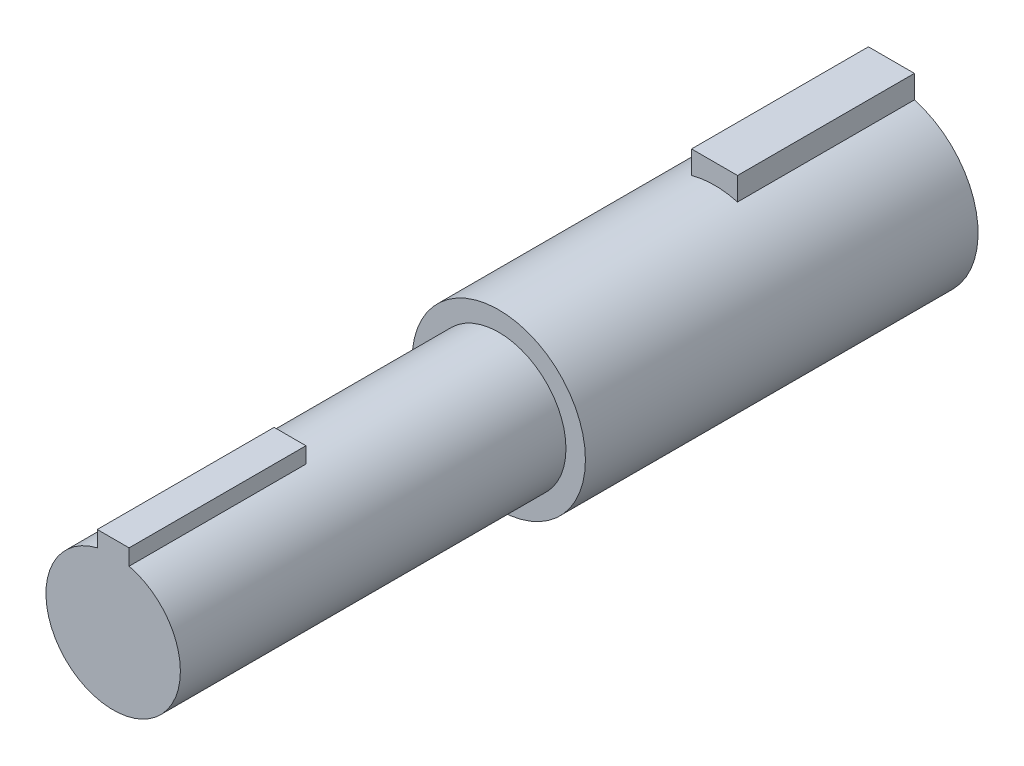
ISO-10303-21;
HEADER;
FILE_DESCRIPTION(('STEP AP214'),'2;1');
FILE_NAME('part.step','',(''),(''),'','','');
FILE_SCHEMA(('AUTOMOTIVE_DESIGN { 1 0 10303 214 1 1 1 1 }'));
ENDSEC;
DATA;
#1=APPLICATION_CONTEXT('core data for automotive mechanical design processes');
#2=APPLICATION_PROTOCOL_DEFINITION('international standard','automotive_design',2000,#1);
#3=PRODUCT_CONTEXT('',#1,'mechanical');
#4=PRODUCT('Part','Part','',(#3));
#5=PRODUCT_RELATED_PRODUCT_CATEGORY('part','',(#4));
#6=PRODUCT_DEFINITION_FORMATION('','',#4);
#7=PRODUCT_DEFINITION_CONTEXT('part definition',#1,'design');
#8=PRODUCT_DEFINITION('design','',#6,#7);
#9=PRODUCT_DEFINITION_SHAPE('','',#8);
#10=(LENGTH_UNIT() NAMED_UNIT(*) SI_UNIT(.MILLI.,.METRE.));
#11=(NAMED_UNIT(*) PLANE_ANGLE_UNIT() SI_UNIT($,.RADIAN.));
#12=(NAMED_UNIT(*) SI_UNIT($,.STERADIAN.) SOLID_ANGLE_UNIT());
#13=UNCERTAINTY_MEASURE_WITH_UNIT(LENGTH_MEASURE(1.E-05),#10,'distance_accuracy_value','');
#14=(GEOMETRIC_REPRESENTATION_CONTEXT(3) GLOBAL_UNCERTAINTY_ASSIGNED_CONTEXT((#13)) GLOBAL_UNIT_ASSIGNED_CONTEXT((#10,
#11,#12)) REPRESENTATION_CONTEXT('',''));
#15=CARTESIAN_POINT('',(0.,0.,0.));
#16=DIRECTION('',(0.,0.,1.));
#17=DIRECTION('',(1.,0.,0.));
#18=AXIS2_PLACEMENT_3D('',#15,#16,#17);
#19=CARTESIAN_POINT('',(0.,0.,28.194));
#20=DIRECTION('',(0.,0.,-1.));
#21=DIRECTION('',(-1.,0.,0.));
#22=AXIS2_PLACEMENT_3D('',#19,#20,#21);
#23=CYLINDRICAL_SURFACE('',#22,6.223);
#24=CARTESIAN_POINT('',(0.,0.,0.));
#25=DIRECTION('',(0.,0.,1.));
#26=DIRECTION('',(1.,0.,0.));
#27=AXIS2_PLACEMENT_3D('',#24,#25,#26);
#28=CIRCLE('',#27,6.223);
#29=CARTESIAN_POINT('',(-1.651,5.999993999997,0.));
#30=VERTEX_POINT('',#29);
#31=CARTESIAN_POINT('',(1.651,5.999993999997,0.));
#32=VERTEX_POINT('',#31);
#33=EDGE_CURVE('E156',#30,#32,#28,.T.);
#34=ORIENTED_EDGE('',*,*,#33,.T.);
#35=DIRECTION('',(0.,0.,-1.));
#36=VECTOR('',#35,1.);
#37=CARTESIAN_POINT('',(1.651,5.999993999997,28.194));
#38=LINE('',#37,#36);
#39=CARTESIAN_POINT('',(1.651,5.999993999997,12.7));
#40=VERTEX_POINT('',#39);
#41=EDGE_CURVE('E47',#32,#40,#38,.F.);
#42=ORIENTED_EDGE('',*,*,#41,.T.);
#43=CARTESIAN_POINT('',(0.,0.,12.7));
#44=DIRECTION('',(0.,0.,-1.));
#45=DIRECTION('',(-1.,0.,0.));
#46=AXIS2_PLACEMENT_3D('',#43,#44,#45);
#47=CIRCLE('',#46,6.223);
#48=CARTESIAN_POINT('',(-1.651,5.999993999997,12.7));
#49=VERTEX_POINT('',#48);
#50=EDGE_CURVE('E11',#49,#40,#47,.T.);
#51=ORIENTED_EDGE('',*,*,#50,.F.);
#52=DIRECTION('',(0.,0.,-1.));
#53=VECTOR('',#52,1.);
#54=CARTESIAN_POINT('',(-1.651,5.999993999997,28.194));
#55=LINE('',#54,#53);
#56=EDGE_CURVE('E100',#49,#30,#55,.T.);
#57=ORIENTED_EDGE('',*,*,#56,.T.);
#58=EDGE_LOOP('',(#34,#42,#51,#57));
#59=FACE_BOUND('',#58,.T.);
#60=CARTESIAN_POINT('',(0.,0.,28.194));
#61=DIRECTION('',(0.,0.,1.));
#62=DIRECTION('',(1.,0.,0.));
#63=AXIS2_PLACEMENT_3D('',#60,#61,#62);
#64=CIRCLE('',#63,6.223);
#65=CARTESIAN_POINT('',(6.223,0.,28.194));
#66=VERTEX_POINT('',#65);
#67=EDGE_CURVE('E157',#66,#66,#64,.T.);
#68=ORIENTED_EDGE('',*,*,#67,.F.);
#69=EDGE_LOOP('',(#68));
#70=FACE_BOUND('',#69,.T.);
#71=ADVANCED_FACE('F33',(#59,#70),#23,.T.);
#72=CARTESIAN_POINT('',(0.,0.,28.194));
#73=DIRECTION('',(0.,0.,1.));
#74=DIRECTION('',(1.,0.,0.));
#75=AXIS2_PLACEMENT_3D('',#72,#73,#74);
#76=PLANE('',#75);
#77=CARTESIAN_POINT('',(0.,0.,28.194));
#78=DIRECTION('',(0.,0.,1.));
#79=DIRECTION('',(1.,0.,0.));
#80=AXIS2_PLACEMENT_3D('',#77,#78,#79);
#81=CIRCLE('',#80,4.826);
#82=CARTESIAN_POINT('',(4.826,0.,28.194));
#83=VERTEX_POINT('',#82);
#84=EDGE_CURVE('E160',#83,#83,#81,.T.);
#85=ORIENTED_EDGE('',*,*,#84,.F.);
#86=EDGE_LOOP('',(#85));
#87=FACE_BOUND('',#86,.T.);
#88=ORIENTED_EDGE('',*,*,#67,.T.);
#89=EDGE_LOOP('',(#88));
#90=FACE_BOUND('',#89,.T.);
#91=ADVANCED_FACE('F197',(#87,#90),#76,.T.);
#92=CARTESIAN_POINT('',(0.,0.,0.));
#93=DIRECTION('',(0.,0.,1.));
#94=DIRECTION('',(1.,0.,0.));
#95=AXIS2_PLACEMENT_3D('',#92,#93,#94);
#96=PLANE('',#95);
#97=ORIENTED_EDGE('',*,*,#33,.F.);
#98=DIRECTION('',(0.,1.,0.));
#99=VECTOR('',#98,1.);
#100=CARTESIAN_POINT('',(-1.651,7.650993999997,0.));
#101=LINE('',#100,#99);
#102=CARTESIAN_POINT('',(-1.651,7.650993999997,0.));
#103=VERTEX_POINT('',#102);
#104=EDGE_CURVE('E122',#30,#103,#101,.T.);
#105=ORIENTED_EDGE('',*,*,#104,.T.);
#106=DIRECTION('',(1.,0.,0.));
#107=VECTOR('',#106,1.);
#108=CARTESIAN_POINT('',(1.651,7.650993999997,0.));
#109=LINE('',#108,#107);
#110=CARTESIAN_POINT('',(1.651,7.650993999997,0.));
#111=VERTEX_POINT('',#110);
#112=EDGE_CURVE('E110',#103,#111,#109,.T.);
#113=ORIENTED_EDGE('',*,*,#112,.T.);
#114=DIRECTION('',(0.,-1.,0.));
#115=VECTOR('',#114,1.);
#116=CARTESIAN_POINT('',(1.651,7.650993999997,0.));
#117=LINE('',#116,#115);
#118=EDGE_CURVE('E119',#111,#32,#117,.T.);
#119=ORIENTED_EDGE('',*,*,#118,.T.);
#120=EDGE_LOOP('',(#97,#105,#113,#119));
#121=FACE_BOUND('',#120,.T.);
#122=ADVANCED_FACE('F194',(#121),#96,.F.);
#123=CARTESIAN_POINT('',(0.,0.,23.114));
#124=DIRECTION('',(0.,0.,1.));
#125=DIRECTION('',(1.,0.,0.));
#126=AXIS2_PLACEMENT_3D('',#123,#124,#125);
#127=CYLINDRICAL_SURFACE('',#126,4.826);
#128=DIRECTION('',(0.,0.,1.));
#129=VECTOR('',#128,1.);
#130=CARTESIAN_POINT('',(-1.143,4.68869139526158,23.114));
#131=LINE('',#130,#129);
#132=CARTESIAN_POINT('',(-1.143,4.68869139526158,43.18));
#133=VERTEX_POINT('',#132);
#134=CARTESIAN_POINT('',(-1.143,4.68869139526158,55.88));
#135=VERTEX_POINT('',#134);
#136=EDGE_CURVE('E150',#133,#135,#131,.T.);
#137=ORIENTED_EDGE('',*,*,#136,.F.);
#138=CARTESIAN_POINT('',(0.,0.,43.18));
#139=DIRECTION('',(0.,0.,1.));
#140=DIRECTION('',(1.,0.,0.));
#141=AXIS2_PLACEMENT_3D('',#138,#139,#140);
#142=CIRCLE('',#141,4.826);
#143=CARTESIAN_POINT('',(1.143,4.68869139526158,43.18));
#144=VERTEX_POINT('',#143);
#145=EDGE_CURVE('E40',#133,#144,#142,.F.);
#146=ORIENTED_EDGE('',*,*,#145,.T.);
#147=DIRECTION('',(0.,0.,1.));
#148=VECTOR('',#147,1.);
#149=CARTESIAN_POINT('',(1.143,4.68869139526158,23.114));
#150=LINE('',#149,#148);
#151=CARTESIAN_POINT('',(1.143,4.68869139526158,55.88));
#152=VERTEX_POINT('',#151);
#153=EDGE_CURVE('E146',#152,#144,#150,.F.);
#154=ORIENTED_EDGE('',*,*,#153,.F.);
#155=CARTESIAN_POINT('',(0.,0.,55.88));
#156=DIRECTION('',(0.,0.,1.));
#157=DIRECTION('',(1.,0.,0.));
#158=AXIS2_PLACEMENT_3D('',#155,#156,#157);
#159=CIRCLE('',#158,4.826);
#160=EDGE_CURVE('E153',#135,#152,#159,.T.);
#161=ORIENTED_EDGE('',*,*,#160,.F.);
#162=EDGE_LOOP('',(#137,#146,#154,#161));
#163=FACE_BOUND('',#162,.T.);
#164=ORIENTED_EDGE('',*,*,#84,.T.);
#165=EDGE_LOOP('',(#164));
#166=FACE_BOUND('',#165,.T.);
#167=ADVANCED_FACE('F167',(#163,#166),#127,.T.);
#168=CARTESIAN_POINT('',(0.,0.,55.88));
#169=DIRECTION('',(0.,0.,1.));
#170=DIRECTION('',(1.,0.,0.));
#171=AXIS2_PLACEMENT_3D('',#168,#169,#170);
#172=PLANE('',#171);
#173=ORIENTED_EDGE('',*,*,#160,.T.);
#174=DIRECTION('',(0.,1.,0.));
#175=VECTOR('',#174,1.);
#176=CARTESIAN_POINT('',(1.143,5.83169139526158,55.88));
#177=LINE('',#176,#175);
#178=CARTESIAN_POINT('',(1.143,5.83169139526158,55.88));
#179=VERTEX_POINT('',#178);
#180=EDGE_CURVE('E140',#152,#179,#177,.T.);
#181=ORIENTED_EDGE('',*,*,#180,.T.);
#182=DIRECTION('',(-1.,0.,0.));
#183=VECTOR('',#182,1.);
#184=CARTESIAN_POINT('',(-1.143,5.83169139526158,55.88));
#185=LINE('',#184,#183);
#186=CARTESIAN_POINT('',(-1.143,5.83169139526158,55.88));
#187=VERTEX_POINT('',#186);
#188=EDGE_CURVE('E133',#179,#187,#185,.T.);
#189=ORIENTED_EDGE('',*,*,#188,.T.);
#190=DIRECTION('',(0.,-1.,0.));
#191=VECTOR('',#190,1.);
#192=CARTESIAN_POINT('',(-1.143,5.83169139526158,55.88));
#193=LINE('',#192,#191);
#194=EDGE_CURVE('E128',#187,#135,#193,.T.);
#195=ORIENTED_EDGE('',*,*,#194,.T.);
#196=EDGE_LOOP('',(#173,#181,#189,#195));
#197=FACE_BOUND('',#196,.T.);
#198=ADVANCED_FACE('F185',(#197),#172,.T.);
#199=CARTESIAN_POINT('',(-1.143,5.83169139526158,43.18));
#200=DIRECTION('',(-1.,0.,0.));
#201=DIRECTION('',(0.,0.,1.));
#202=AXIS2_PLACEMENT_3D('',#199,#200,#201);
#203=PLANE('',#202);
#204=DIRECTION('',(0.,-1.,0.));
#205=VECTOR('',#204,1.);
#206=CARTESIAN_POINT('',(-1.143,5.83169139526158,43.18));
#207=LINE('',#206,#205);
#208=CARTESIAN_POINT('',(-1.143,5.83169139526158,43.18));
#209=VERTEX_POINT('',#208);
#210=EDGE_CURVE('E129',#209,#133,#207,.T.);
#211=ORIENTED_EDGE('',*,*,#210,.T.);
#212=ORIENTED_EDGE('',*,*,#136,.T.);
#213=ORIENTED_EDGE('',*,*,#194,.F.);
#214=DIRECTION('',(0.,0.,1.));
#215=VECTOR('',#214,1.);
#216=CARTESIAN_POINT('',(-1.143,5.83169139526158,43.18));
#217=LINE('',#216,#215);
#218=EDGE_CURVE('E144',#209,#187,#217,.T.);
#219=ORIENTED_EDGE('',*,*,#218,.F.);
#220=EDGE_LOOP('',(#211,#212,#213,#219));
#221=FACE_BOUND('',#220,.T.);
#222=ADVANCED_FACE('F176',(#221),#203,.T.);
#223=CARTESIAN_POINT('',(-1.143,5.83169139526158,43.18));
#224=DIRECTION('',(0.,1.,0.));
#225=DIRECTION('',(0.,0.,1.));
#226=AXIS2_PLACEMENT_3D('',#223,#224,#225);
#227=PLANE('',#226);
#228=ORIENTED_EDGE('',*,*,#188,.F.);
#229=DIRECTION('',(0.,0.,1.));
#230=VECTOR('',#229,1.);
#231=CARTESIAN_POINT('',(1.143,5.83169139526158,43.18));
#232=LINE('',#231,#230);
#233=CARTESIAN_POINT('',(1.143,5.83169139526158,43.18));
#234=VERTEX_POINT('',#233);
#235=EDGE_CURVE('E138',#234,#179,#232,.T.);
#236=ORIENTED_EDGE('',*,*,#235,.F.);
#237=DIRECTION('',(-1.,0.,0.));
#238=VECTOR('',#237,1.);
#239=CARTESIAN_POINT('',(-1.143,5.83169139526158,43.18));
#240=LINE('',#239,#238);
#241=EDGE_CURVE('E135',#234,#209,#240,.T.);
#242=ORIENTED_EDGE('',*,*,#241,.T.);
#243=ORIENTED_EDGE('',*,*,#218,.T.);
#244=EDGE_LOOP('',(#228,#236,#242,#243));
#245=FACE_BOUND('',#244,.T.);
#246=ADVANCED_FACE('F180',(#245),#227,.T.);
#247=CARTESIAN_POINT('',(1.143,5.83169139526158,43.18));
#248=DIRECTION('',(1.,0.,0.));
#249=DIRECTION('',(0.,1.,0.));
#250=AXIS2_PLACEMENT_3D('',#247,#248,#249);
#251=PLANE('',#250);
#252=ORIENTED_EDGE('',*,*,#180,.F.);
#253=ORIENTED_EDGE('',*,*,#153,.T.);
#254=DIRECTION('',(0.,1.,0.));
#255=VECTOR('',#254,1.);
#256=CARTESIAN_POINT('',(1.143,5.83169139526158,43.18));
#257=LINE('',#256,#255);
#258=EDGE_CURVE('E132',#144,#234,#257,.T.);
#259=ORIENTED_EDGE('',*,*,#258,.T.);
#260=ORIENTED_EDGE('',*,*,#235,.T.);
#261=EDGE_LOOP('',(#252,#253,#259,#260));
#262=FACE_BOUND('',#261,.T.);
#263=ADVANCED_FACE('F183',(#262),#251,.T.);
#264=CARTESIAN_POINT('',(0.,0.,43.18));
#265=DIRECTION('',(0.,0.,1.));
#266=DIRECTION('',(1.,0.,0.));
#267=AXIS2_PLACEMENT_3D('',#264,#265,#266);
#268=PLANE('',#267);
#269=ORIENTED_EDGE('',*,*,#145,.F.);
#270=ORIENTED_EDGE('',*,*,#210,.F.);
#271=ORIENTED_EDGE('',*,*,#241,.F.);
#272=ORIENTED_EDGE('',*,*,#258,.F.);
#273=EDGE_LOOP('',(#269,#270,#271,#272));
#274=FACE_BOUND('',#273,.T.);
#275=ADVANCED_FACE('F173',(#274),#268,.F.);
#276=CARTESIAN_POINT('',(1.651,7.650993999997,12.7));
#277=DIRECTION('',(1.,0.,0.));
#278=DIRECTION('',(0.,0.,-1.));
#279=AXIS2_PLACEMENT_3D('',#276,#277,#278);
#280=PLANE('',#279);
#281=ORIENTED_EDGE('',*,*,#41,.F.);
#282=ORIENTED_EDGE('',*,*,#118,.F.);
#283=DIRECTION('',(0.,0.,-1.));
#284=VECTOR('',#283,1.);
#285=CARTESIAN_POINT('',(1.651,7.650993999997,12.7));
#286=LINE('',#285,#284);
#287=CARTESIAN_POINT('',(1.651,7.650993999997,12.7));
#288=VERTEX_POINT('',#287);
#289=EDGE_CURVE('E111',#288,#111,#286,.T.);
#290=ORIENTED_EDGE('',*,*,#289,.F.);
#291=DIRECTION('',(0.,-1.,0.));
#292=VECTOR('',#291,1.);
#293=CARTESIAN_POINT('',(1.651,7.650993999997,12.7));
#294=LINE('',#293,#292);
#295=EDGE_CURVE('E104',#288,#40,#294,.T.);
#296=ORIENTED_EDGE('',*,*,#295,.T.);
#297=EDGE_LOOP('',(#281,#282,#290,#296));
#298=FACE_BOUND('',#297,.T.);
#299=ADVANCED_FACE('F211',(#298),#280,.T.);
#300=CARTESIAN_POINT('',(-1.651,7.650993999997,12.7));
#301=DIRECTION('',(-1.,0.,0.));
#302=DIRECTION('',(0.,-1.,0.));
#303=AXIS2_PLACEMENT_3D('',#300,#301,#302);
#304=PLANE('',#303);
#305=ORIENTED_EDGE('',*,*,#56,.F.);
#306=DIRECTION('',(0.,1.,0.));
#307=VECTOR('',#306,1.);
#308=CARTESIAN_POINT('',(-1.651,7.650993999997,12.7));
#309=LINE('',#308,#307);
#310=CARTESIAN_POINT('',(-1.651,7.650993999997,12.7));
#311=VERTEX_POINT('',#310);
#312=EDGE_CURVE('E94',#49,#311,#309,.T.);
#313=ORIENTED_EDGE('',*,*,#312,.T.);
#314=DIRECTION('',(0.,0.,-1.));
#315=VECTOR('',#314,1.);
#316=CARTESIAN_POINT('',(-1.651,7.650993999997,12.7));
#317=LINE('',#316,#315);
#318=EDGE_CURVE('E98',#311,#103,#317,.T.);
#319=ORIENTED_EDGE('',*,*,#318,.T.);
#320=ORIENTED_EDGE('',*,*,#104,.F.);
#321=EDGE_LOOP('',(#305,#313,#319,#320));
#322=FACE_BOUND('',#321,.T.);
#323=ADVANCED_FACE('F96',(#322),#304,.T.);
#324=CARTESIAN_POINT('',(1.651,7.650993999997,12.7));
#325=DIRECTION('',(0.,1.,0.));
#326=DIRECTION('',(0.,0.,1.));
#327=AXIS2_PLACEMENT_3D('',#324,#325,#326);
#328=PLANE('',#327);
#329=ORIENTED_EDGE('',*,*,#112,.F.);
#330=ORIENTED_EDGE('',*,*,#318,.F.);
#331=DIRECTION('',(1.,0.,0.));
#332=VECTOR('',#331,1.);
#333=CARTESIAN_POINT('',(1.651,7.650993999997,12.7));
#334=LINE('',#333,#332);
#335=EDGE_CURVE('E103',#311,#288,#334,.T.);
#336=ORIENTED_EDGE('',*,*,#335,.T.);
#337=ORIENTED_EDGE('',*,*,#289,.T.);
#338=EDGE_LOOP('',(#329,#330,#336,#337));
#339=FACE_BOUND('',#338,.T.);
#340=ADVANCED_FACE('F108',(#339),#328,.T.);
#341=CARTESIAN_POINT('',(0.,0.,12.7));
#342=DIRECTION('',(0.,0.,-1.));
#343=DIRECTION('',(-1.,0.,0.));
#344=AXIS2_PLACEMENT_3D('',#341,#342,#343);
#345=PLANE('',#344);
#346=ORIENTED_EDGE('',*,*,#312,.F.);
#347=ORIENTED_EDGE('',*,*,#50,.T.);
#348=ORIENTED_EDGE('',*,*,#295,.F.);
#349=ORIENTED_EDGE('',*,*,#335,.F.);
#350=EDGE_LOOP('',(#346,#347,#348,#349));
#351=FACE_BOUND('',#350,.T.);
#352=ADVANCED_FACE('F114',(#351),#345,.F.);
#353=CLOSED_SHELL('',(#71,#91,#122,#167,#198,#222,#246,#263,#275,#299,#323,#340,#352));
#354=MANIFOLD_SOLID_BREP('B2',#353);
#355=ADVANCED_BREP_SHAPE_REPRESENTATION('',(#18,#354),#14);
#356=SHAPE_DEFINITION_REPRESENTATION(#9,#355);
ENDSEC;
END-ISO-10303-21;
